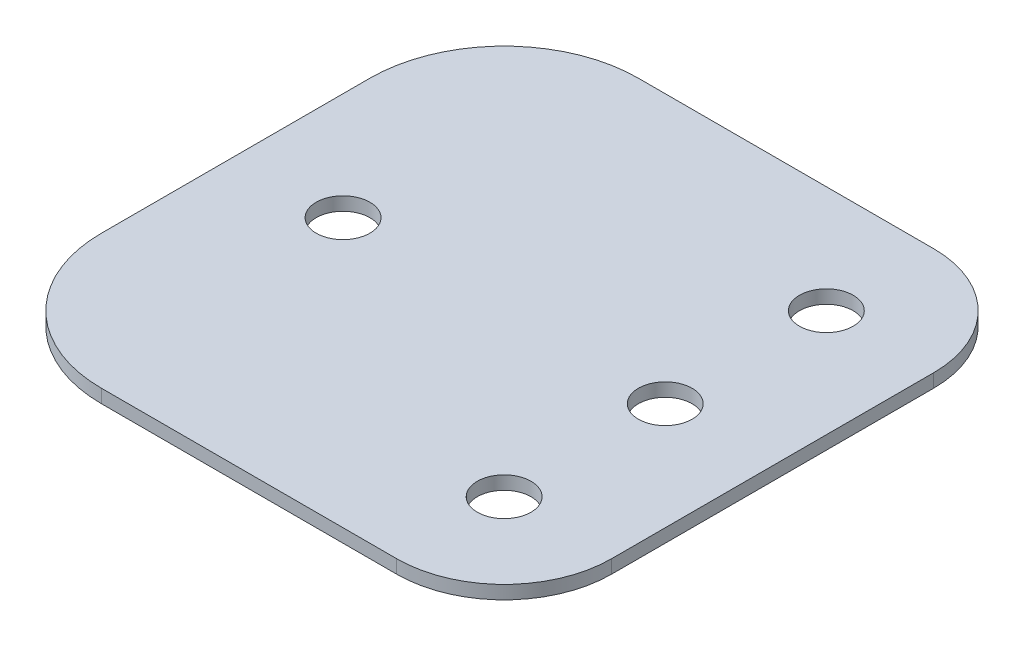
ISO-10303-21;
HEADER;
FILE_DESCRIPTION(('STEP AP214'),'2;1');
FILE_NAME('part.step','',(''),(''),'','','');
FILE_SCHEMA(('AUTOMOTIVE_DESIGN { 1 0 10303 214 1 1 1 1 }'));
ENDSEC;
DATA;
#1=APPLICATION_CONTEXT('core data for automotive mechanical design processes');
#2=APPLICATION_PROTOCOL_DEFINITION('international standard','automotive_design',2000,#1);
#3=PRODUCT_CONTEXT('',#1,'mechanical');
#4=PRODUCT('Part','Part','',(#3));
#5=PRODUCT_RELATED_PRODUCT_CATEGORY('part','',(#4));
#6=PRODUCT_DEFINITION_FORMATION('','',#4);
#7=PRODUCT_DEFINITION_CONTEXT('part definition',#1,'design');
#8=PRODUCT_DEFINITION('design','',#6,#7);
#9=PRODUCT_DEFINITION_SHAPE('','',#8);
#10=(LENGTH_UNIT() NAMED_UNIT(*) SI_UNIT(.MILLI.,.METRE.));
#11=(NAMED_UNIT(*) PLANE_ANGLE_UNIT() SI_UNIT($,.RADIAN.));
#12=(NAMED_UNIT(*) SI_UNIT($,.STERADIAN.) SOLID_ANGLE_UNIT());
#13=UNCERTAINTY_MEASURE_WITH_UNIT(LENGTH_MEASURE(1.E-05),#10,'distance_accuracy_value','');
#14=(GEOMETRIC_REPRESENTATION_CONTEXT(3) GLOBAL_UNCERTAINTY_ASSIGNED_CONTEXT((#13)) GLOBAL_UNIT_ASSIGNED_CONTEXT((#10,
#11,#12)) REPRESENTATION_CONTEXT('',''));
#15=CARTESIAN_POINT('',(0.,0.,0.));
#16=DIRECTION('',(0.,0.,1.));
#17=DIRECTION('',(1.,0.,0.));
#18=AXIS2_PLACEMENT_3D('',#15,#16,#17);
#19=CARTESIAN_POINT('',(0.,1.5875,0.));
#20=DIRECTION('',(0.,0.,1.));
#21=DIRECTION('',(1.,0.,0.));
#22=AXIS2_PLACEMENT_3D('',#19,#20,#21);
#23=PLANE('',#22);
#24=DIRECTION('',(-1.,0.,0.));
#25=VECTOR('',#24,1.);
#26=CARTESIAN_POINT('',(0.,0.,0.));
#27=LINE('',#26,#25);
#28=CARTESIAN_POINT('',(-12.7,0.,0.));
#29=VERTEX_POINT('',#28);
#30=CARTESIAN_POINT('',(-47.625,0.,0.));
#31=VERTEX_POINT('',#30);
#32=EDGE_CURVE('E156',#29,#31,#27,.T.);
#33=ORIENTED_EDGE('',*,*,#32,.F.);
#34=DIRECTION('',(0.,-1.,0.));
#35=VECTOR('',#34,1.);
#36=CARTESIAN_POINT('',(-12.7,1.5875,0.));
#37=LINE('',#36,#35);
#38=CARTESIAN_POINT('',(-12.7,1.5875,0.));
#39=VERTEX_POINT('',#38);
#40=EDGE_CURVE('E11',#39,#29,#37,.T.);
#41=ORIENTED_EDGE('',*,*,#40,.F.);
#42=DIRECTION('',(-1.,0.,0.));
#43=VECTOR('',#42,1.);
#44=CARTESIAN_POINT('',(0.,1.5875,0.));
#45=LINE('',#44,#43);
#46=CARTESIAN_POINT('',(-47.625,1.5875,0.));
#47=VERTEX_POINT('',#46);
#48=EDGE_CURVE('E365',#39,#47,#45,.T.);
#49=ORIENTED_EDGE('',*,*,#48,.T.);
#50=DIRECTION('',(0.,-1.,0.));
#51=VECTOR('',#50,1.);
#52=CARTESIAN_POINT('',(-47.625,1.5875,0.));
#53=LINE('',#52,#51);
#54=EDGE_CURVE('E93',#47,#31,#53,.T.);
#55=ORIENTED_EDGE('',*,*,#54,.T.);
#56=EDGE_LOOP('',(#33,#41,#49,#55));
#57=FACE_BOUND('',#56,.T.);
#58=ADVANCED_FACE('F41',(#57),#23,.T.);
#59=CARTESIAN_POINT('',(-12.7,1.5875,-12.7));
#60=DIRECTION('',(0.,-1.,0.));
#61=DIRECTION('',(0.,0.,-1.));
#62=AXIS2_PLACEMENT_3D('',#59,#60,#61);
#63=CYLINDRICAL_SURFACE('',#62,12.7);
#64=CARTESIAN_POINT('',(-12.7,0.,-12.7));
#65=DIRECTION('',(0.,1.,0.));
#66=DIRECTION('',(0.,0.,1.));
#67=AXIS2_PLACEMENT_3D('',#64,#65,#66);
#68=CIRCLE('',#67,12.7);
#69=CARTESIAN_POINT('',(0.,0.,-12.7));
#70=VERTEX_POINT('',#69);
#71=EDGE_CURVE('E160',#29,#70,#68,.T.);
#72=ORIENTED_EDGE('',*,*,#71,.T.);
#73=DIRECTION('',(0.,-1.,0.));
#74=VECTOR('',#73,1.);
#75=CARTESIAN_POINT('',(0.,1.5875,-12.7));
#76=LINE('',#75,#74);
#77=CARTESIAN_POINT('',(0.,1.5875,-12.7));
#78=VERTEX_POINT('',#77);
#79=EDGE_CURVE('E51',#78,#70,#76,.T.);
#80=ORIENTED_EDGE('',*,*,#79,.F.);
#81=CARTESIAN_POINT('',(-12.7,1.5875,-12.7));
#82=DIRECTION('',(0.,1.,0.));
#83=DIRECTION('',(0.,0.,1.));
#84=AXIS2_PLACEMENT_3D('',#81,#82,#83);
#85=CIRCLE('',#84,12.7);
#86=EDGE_CURVE('E360',#39,#78,#85,.T.);
#87=ORIENTED_EDGE('',*,*,#86,.F.);
#88=ORIENTED_EDGE('',*,*,#40,.T.);
#89=EDGE_LOOP('',(#72,#80,#87,#88));
#90=FACE_BOUND('',#89,.T.);
#91=ADVANCED_FACE('F209',(#90),#63,.T.);
#92=CARTESIAN_POINT('',(0.,1.5875,0.));
#93=DIRECTION('',(-1.,0.,0.));
#94=DIRECTION('',(0.,0.,1.));
#95=AXIS2_PLACEMENT_3D('',#92,#93,#94);
#96=PLANE('',#95);
#97=DIRECTION('',(0.,0.,-1.));
#98=VECTOR('',#97,1.);
#99=CARTESIAN_POINT('',(0.,0.,0.));
#100=LINE('',#99,#98);
#101=CARTESIAN_POINT('',(0.,0.,-50.8));
#102=VERTEX_POINT('',#101);
#103=EDGE_CURVE('E164',#70,#102,#100,.T.);
#104=ORIENTED_EDGE('',*,*,#103,.T.);
#105=DIRECTION('',(0.,-1.,0.));
#106=VECTOR('',#105,1.);
#107=CARTESIAN_POINT('',(0.,1.5875,-50.8));
#108=LINE('',#107,#106);
#109=CARTESIAN_POINT('',(0.,1.5875,-50.8));
#110=VERTEX_POINT('',#109);
#111=EDGE_CURVE('E195',#110,#102,#108,.T.);
#112=ORIENTED_EDGE('',*,*,#111,.F.);
#113=DIRECTION('',(0.,0.,-1.));
#114=VECTOR('',#113,1.);
#115=CARTESIAN_POINT('',(0.,1.5875,0.));
#116=LINE('',#115,#114);
#117=EDGE_CURVE('E205',#78,#110,#116,.T.);
#118=ORIENTED_EDGE('',*,*,#117,.F.);
#119=ORIENTED_EDGE('',*,*,#79,.T.);
#120=EDGE_LOOP('',(#104,#112,#118,#119));
#121=FACE_BOUND('',#120,.T.);
#122=ADVANCED_FACE('F202',(#121),#96,.F.);
#123=CARTESIAN_POINT('',(-12.7,1.5875,-50.8));
#124=DIRECTION('',(0.,-1.,0.));
#125=DIRECTION('',(0.,0.,-1.));
#126=AXIS2_PLACEMENT_3D('',#123,#124,#125);
#127=CYLINDRICAL_SURFACE('',#126,12.7);
#128=CARTESIAN_POINT('',(-12.7,0.,-50.8));
#129=DIRECTION('',(0.,1.,0.));
#130=DIRECTION('',(0.,0.,1.));
#131=AXIS2_PLACEMENT_3D('',#128,#129,#130);
#132=CIRCLE('',#131,12.7);
#133=CARTESIAN_POINT('',(-12.7,0.,-63.5));
#134=VERTEX_POINT('',#133);
#135=EDGE_CURVE('E168',#102,#134,#132,.T.);
#136=ORIENTED_EDGE('',*,*,#135,.T.);
#137=DIRECTION('',(0.,-1.,0.));
#138=VECTOR('',#137,1.);
#139=CARTESIAN_POINT('',(-12.7,1.5875,-63.5));
#140=LINE('',#139,#138);
#141=CARTESIAN_POINT('',(-12.7,1.5875,-63.5));
#142=VERTEX_POINT('',#141);
#143=EDGE_CURVE('E191',#142,#134,#140,.T.);
#144=ORIENTED_EDGE('',*,*,#143,.F.);
#145=CARTESIAN_POINT('',(-12.7,1.5875,-50.8));
#146=DIRECTION('',(0.,1.,0.));
#147=DIRECTION('',(0.,0.,1.));
#148=AXIS2_PLACEMENT_3D('',#145,#146,#147);
#149=CIRCLE('',#148,12.7);
#150=EDGE_CURVE('E356',#110,#142,#149,.T.);
#151=ORIENTED_EDGE('',*,*,#150,.F.);
#152=ORIENTED_EDGE('',*,*,#111,.T.);
#153=EDGE_LOOP('',(#136,#144,#151,#152));
#154=FACE_BOUND('',#153,.T.);
#155=ADVANCED_FACE('F265',(#154),#127,.T.);
#156=CARTESIAN_POINT('',(0.,1.5875,-63.5));
#157=DIRECTION('',(0.,0.,1.));
#158=DIRECTION('',(1.,0.,0.));
#159=AXIS2_PLACEMENT_3D('',#156,#157,#158);
#160=PLANE('',#159);
#161=DIRECTION('',(-1.,0.,0.));
#162=VECTOR('',#161,1.);
#163=CARTESIAN_POINT('',(0.,0.,-63.5));
#164=LINE('',#163,#162);
#165=CARTESIAN_POINT('',(-47.625,0.,-63.5));
#166=VERTEX_POINT('',#165);
#167=EDGE_CURVE('E172',#134,#166,#164,.T.);
#168=ORIENTED_EDGE('',*,*,#167,.T.);
#169=DIRECTION('',(0.,-1.,0.));
#170=VECTOR('',#169,1.);
#171=CARTESIAN_POINT('',(-47.625,1.5875,-63.5));
#172=LINE('',#171,#170);
#173=CARTESIAN_POINT('',(-47.625,1.5875,-63.5));
#174=VERTEX_POINT('',#173);
#175=EDGE_CURVE('E124',#174,#166,#172,.T.);
#176=ORIENTED_EDGE('',*,*,#175,.F.);
#177=DIRECTION('',(-1.,0.,0.));
#178=VECTOR('',#177,1.);
#179=CARTESIAN_POINT('',(0.,1.5875,-63.5));
#180=LINE('',#179,#178);
#181=EDGE_CURVE('E129',#142,#174,#180,.T.);
#182=ORIENTED_EDGE('',*,*,#181,.F.);
#183=ORIENTED_EDGE('',*,*,#143,.T.);
#184=EDGE_LOOP('',(#168,#176,#182,#183));
#185=FACE_BOUND('',#184,.T.);
#186=ADVANCED_FACE('F262',(#185),#160,.F.);
#187=CARTESIAN_POINT('',(-47.625,1.5875,-47.625));
#188=DIRECTION('',(0.,-1.,0.));
#189=DIRECTION('',(0.,0.,-1.));
#190=AXIS2_PLACEMENT_3D('',#187,#188,#189);
#191=CYLINDRICAL_SURFACE('',#190,15.875);
#192=CARTESIAN_POINT('',(-47.625,0.,-47.625));
#193=DIRECTION('',(0.,1.,0.));
#194=DIRECTION('',(0.,0.,1.));
#195=AXIS2_PLACEMENT_3D('',#192,#193,#194);
#196=CIRCLE('',#195,15.875);
#197=CARTESIAN_POINT('',(-63.5,0.,-47.625));
#198=VERTEX_POINT('',#197);
#199=EDGE_CURVE('E118',#198,#166,#196,.F.);
#200=ORIENTED_EDGE('',*,*,#199,.F.);
#201=DIRECTION('',(0.,-1.,0.));
#202=VECTOR('',#201,1.);
#203=CARTESIAN_POINT('',(-63.5,1.5875,-47.625));
#204=LINE('',#203,#202);
#205=CARTESIAN_POINT('',(-63.5,1.5875,-47.625));
#206=VERTEX_POINT('',#205);
#207=EDGE_CURVE('E113',#206,#198,#204,.T.);
#208=ORIENTED_EDGE('',*,*,#207,.F.);
#209=CARTESIAN_POINT('',(-47.625,1.5875,-47.625));
#210=DIRECTION('',(0.,1.,0.));
#211=DIRECTION('',(0.,0.,1.));
#212=AXIS2_PLACEMENT_3D('',#209,#210,#211);
#213=CIRCLE('',#212,15.875);
#214=EDGE_CURVE('E116',#206,#174,#213,.F.);
#215=ORIENTED_EDGE('',*,*,#214,.T.);
#216=ORIENTED_EDGE('',*,*,#175,.T.);
#217=EDGE_LOOP('',(#200,#208,#215,#216));
#218=FACE_BOUND('',#217,.T.);
#219=ADVANCED_FACE('F115',(#218),#191,.T.);
#220=CARTESIAN_POINT('',(-63.5000000000002,1.5875,-2.77555756156293E-13));
#221=DIRECTION('',(-1.,0.,0.));
#222=DIRECTION('',(0.,0.,1.));
#223=AXIS2_PLACEMENT_3D('',#220,#221,#222);
#224=PLANE('',#223);
#225=DIRECTION('',(0.,0.,-1.));
#226=VECTOR('',#225,1.);
#227=CARTESIAN_POINT('',(-63.5000000000002,0.,-2.77555756156293E-13));
#228=LINE('',#227,#226);
#229=CARTESIAN_POINT('',(-63.5,0.,-15.875));
#230=VERTEX_POINT('',#229);
#231=EDGE_CURVE('E178',#230,#198,#228,.T.);
#232=ORIENTED_EDGE('',*,*,#231,.F.);
#233=DIRECTION('',(0.,-1.,0.));
#234=VECTOR('',#233,1.);
#235=CARTESIAN_POINT('',(-63.5,1.5875,-15.875));
#236=LINE('',#235,#234);
#237=CARTESIAN_POINT('',(-63.5,1.5875,-15.875));
#238=VERTEX_POINT('',#237);
#239=EDGE_CURVE('E86',#238,#230,#236,.T.);
#240=ORIENTED_EDGE('',*,*,#239,.F.);
#241=DIRECTION('',(0.,0.,-1.));
#242=VECTOR('',#241,1.);
#243=CARTESIAN_POINT('',(-63.5000000000002,1.5875,-2.77555756156293E-13));
#244=LINE('',#243,#242);
#245=EDGE_CURVE('E127',#238,#206,#244,.T.);
#246=ORIENTED_EDGE('',*,*,#245,.T.);
#247=ORIENTED_EDGE('',*,*,#207,.T.);
#248=EDGE_LOOP('',(#232,#240,#246,#247));
#249=FACE_BOUND('',#248,.T.);
#250=ADVANCED_FACE('F133',(#249),#224,.T.);
#251=CARTESIAN_POINT('',(-50.8,1.5875,-31.75));
#252=DIRECTION('',(0.,-1.,0.));
#253=DIRECTION('',(0.,0.,-1.));
#254=AXIS2_PLACEMENT_3D('',#251,#252,#253);
#255=CYLINDRICAL_SURFACE('',#254,3.17499999999999);
#256=CARTESIAN_POINT('',(-50.8,1.5875,-31.75));
#257=DIRECTION('',(0.,1.,0.));
#258=DIRECTION('',(0.,0.,1.));
#259=AXIS2_PLACEMENT_3D('',#256,#257,#258);
#260=CIRCLE('',#259,3.17499999999999);
#261=CARTESIAN_POINT('',(-50.8,1.5875,-28.575));
#262=VERTEX_POINT('',#261);
#263=EDGE_CURVE('E368',#262,#262,#260,.T.);
#264=ORIENTED_EDGE('',*,*,#263,.T.);
#265=EDGE_LOOP('',(#264));
#266=FACE_BOUND('',#265,.T.);
#267=CARTESIAN_POINT('',(-50.8,0.,-31.75));
#268=DIRECTION('',(0.,1.,0.));
#269=DIRECTION('',(0.,0.,1.));
#270=AXIS2_PLACEMENT_3D('',#267,#268,#269);
#271=CIRCLE('',#270,3.17499999999999);
#272=CARTESIAN_POINT('',(-50.8,0.,-28.575));
#273=VERTEX_POINT('',#272);
#274=EDGE_CURVE('E152',#273,#273,#271,.T.);
#275=ORIENTED_EDGE('',*,*,#274,.F.);
#276=EDGE_LOOP('',(#275));
#277=FACE_BOUND('',#276,.T.);
#278=ADVANCED_FACE('F220',(#266,#277),#255,.F.);
#279=CARTESIAN_POINT('',(-12.7,1.5875,-12.7));
#280=DIRECTION('',(0.,-1.,0.));
#281=DIRECTION('',(0.,0.,-1.));
#282=AXIS2_PLACEMENT_3D('',#279,#280,#281);
#283=CYLINDRICAL_SURFACE('',#282,3.175);
#284=CARTESIAN_POINT('',(-12.7,1.5875,-12.7));
#285=DIRECTION('',(0.,1.,0.));
#286=DIRECTION('',(0.,0.,1.));
#287=AXIS2_PLACEMENT_3D('',#284,#285,#286);
#288=CIRCLE('',#287,3.175);
#289=CARTESIAN_POINT('',(-12.7,1.5875,-9.525));
#290=VERTEX_POINT('',#289);
#291=EDGE_CURVE('E372',#290,#290,#288,.T.);
#292=ORIENTED_EDGE('',*,*,#291,.T.);
#293=EDGE_LOOP('',(#292));
#294=FACE_BOUND('',#293,.T.);
#295=CARTESIAN_POINT('',(-12.7,0.,-12.7));
#296=DIRECTION('',(0.,1.,0.));
#297=DIRECTION('',(0.,0.,1.));
#298=AXIS2_PLACEMENT_3D('',#295,#296,#297);
#299=CIRCLE('',#298,3.175);
#300=CARTESIAN_POINT('',(-12.7,0.,-9.525));
#301=VERTEX_POINT('',#300);
#302=EDGE_CURVE('E148',#301,#301,#299,.T.);
#303=ORIENTED_EDGE('',*,*,#302,.F.);
#304=EDGE_LOOP('',(#303));
#305=FACE_BOUND('',#304,.T.);
#306=ADVANCED_FACE('F223',(#294,#305),#283,.F.);
#307=CARTESIAN_POINT('',(-12.7,1.5875,-31.75));
#308=DIRECTION('',(0.,-1.,0.));
#309=DIRECTION('',(0.,0.,-1.));
#310=AXIS2_PLACEMENT_3D('',#307,#308,#309);
#311=CYLINDRICAL_SURFACE('',#310,3.175);
#312=CARTESIAN_POINT('',(-12.7,1.5875,-31.75));
#313=DIRECTION('',(0.,1.,0.));
#314=DIRECTION('',(0.,0.,1.));
#315=AXIS2_PLACEMENT_3D('',#312,#313,#314);
#316=CIRCLE('',#315,3.175);
#317=CARTESIAN_POINT('',(-12.7,1.5875,-28.575));
#318=VERTEX_POINT('',#317);
#319=EDGE_CURVE('E238',#318,#318,#316,.T.);
#320=ORIENTED_EDGE('',*,*,#319,.T.);
#321=EDGE_LOOP('',(#320));
#322=FACE_BOUND('',#321,.T.);
#323=CARTESIAN_POINT('',(-12.7,0.,-31.75));
#324=DIRECTION('',(0.,1.,0.));
#325=DIRECTION('',(0.,0.,1.));
#326=AXIS2_PLACEMENT_3D('',#323,#324,#325);
#327=CIRCLE('',#326,3.175);
#328=CARTESIAN_POINT('',(-12.7,0.,-28.575));
#329=VERTEX_POINT('',#328);
#330=EDGE_CURVE('E144',#329,#329,#327,.T.);
#331=ORIENTED_EDGE('',*,*,#330,.F.);
#332=EDGE_LOOP('',(#331));
#333=FACE_BOUND('',#332,.T.);
#334=ADVANCED_FACE('F226',(#322,#333),#311,.F.);
#335=CARTESIAN_POINT('',(-12.7,1.5875,-50.8));
#336=DIRECTION('',(0.,-1.,0.));
#337=DIRECTION('',(0.,0.,-1.));
#338=AXIS2_PLACEMENT_3D('',#335,#336,#337);
#339=CYLINDRICAL_SURFACE('',#338,3.175);
#340=CARTESIAN_POINT('',(-12.7,1.5875,-50.8));
#341=DIRECTION('',(0.,1.,0.));
#342=DIRECTION('',(0.,0.,1.));
#343=AXIS2_PLACEMENT_3D('',#340,#341,#342);
#344=CIRCLE('',#343,3.175);
#345=CARTESIAN_POINT('',(-12.7,1.5875,-47.625));
#346=VERTEX_POINT('',#345);
#347=EDGE_CURVE('E184',#346,#346,#344,.T.);
#348=ORIENTED_EDGE('',*,*,#347,.T.);
#349=EDGE_LOOP('',(#348));
#350=FACE_BOUND('',#349,.T.);
#351=CARTESIAN_POINT('',(-12.7,0.,-50.8));
#352=DIRECTION('',(0.,1.,0.));
#353=DIRECTION('',(0.,0.,1.));
#354=AXIS2_PLACEMENT_3D('',#351,#352,#353);
#355=CIRCLE('',#354,3.175);
#356=CARTESIAN_POINT('',(-12.7,0.,-47.625));
#357=VERTEX_POINT('',#356);
#358=EDGE_CURVE('E140',#357,#357,#355,.T.);
#359=ORIENTED_EDGE('',*,*,#358,.F.);
#360=EDGE_LOOP('',(#359));
#361=FACE_BOUND('',#360,.T.);
#362=ADVANCED_FACE('F43',(#350,#361),#339,.F.);
#363=CARTESIAN_POINT('',(-47.625,1.5875,-15.875));
#364=DIRECTION('',(0.,-1.,0.));
#365=DIRECTION('',(0.,0.,-1.));
#366=AXIS2_PLACEMENT_3D('',#363,#364,#365);
#367=CYLINDRICAL_SURFACE('',#366,15.875);
#368=CARTESIAN_POINT('',(-47.625,0.,-15.875));
#369=DIRECTION('',(0.,1.,0.));
#370=DIRECTION('',(0.,0.,1.));
#371=AXIS2_PLACEMENT_3D('',#368,#369,#370);
#372=CIRCLE('',#371,15.875);
#373=EDGE_CURVE('E181',#230,#31,#372,.T.);
#374=ORIENTED_EDGE('',*,*,#373,.T.);
#375=ORIENTED_EDGE('',*,*,#54,.F.);
#376=CARTESIAN_POINT('',(-47.625,1.5875,-15.875));
#377=DIRECTION('',(0.,1.,0.));
#378=DIRECTION('',(0.,0.,1.));
#379=AXIS2_PLACEMENT_3D('',#376,#377,#378);
#380=CIRCLE('',#379,15.875);
#381=EDGE_CURVE('E59',#238,#47,#380,.T.);
#382=ORIENTED_EDGE('',*,*,#381,.F.);
#383=ORIENTED_EDGE('',*,*,#239,.T.);
#384=EDGE_LOOP('',(#374,#375,#382,#383));
#385=FACE_BOUND('',#384,.T.);
#386=ADVANCED_FACE('F233',(#385),#367,.T.);
#387=CARTESIAN_POINT('',(0.,1.5875,0.));
#388=DIRECTION('',(0.,1.,0.));
#389=DIRECTION('',(0.,0.,1.));
#390=AXIS2_PLACEMENT_3D('',#387,#388,#389);
#391=PLANE('',#390);
#392=ORIENTED_EDGE('',*,*,#347,.F.);
#393=EDGE_LOOP('',(#392));
#394=FACE_BOUND('',#393,.T.);
#395=ORIENTED_EDGE('',*,*,#319,.F.);
#396=EDGE_LOOP('',(#395));
#397=FACE_BOUND('',#396,.T.);
#398=ORIENTED_EDGE('',*,*,#291,.F.);
#399=EDGE_LOOP('',(#398));
#400=FACE_BOUND('',#399,.T.);
#401=ORIENTED_EDGE('',*,*,#263,.F.);
#402=EDGE_LOOP('',(#401));
#403=FACE_BOUND('',#402,.T.);
#404=ORIENTED_EDGE('',*,*,#48,.F.);
#405=ORIENTED_EDGE('',*,*,#86,.T.);
#406=ORIENTED_EDGE('',*,*,#117,.T.);
#407=ORIENTED_EDGE('',*,*,#150,.T.);
#408=ORIENTED_EDGE('',*,*,#181,.T.);
#409=ORIENTED_EDGE('',*,*,#214,.F.);
#410=ORIENTED_EDGE('',*,*,#245,.F.);
#411=ORIENTED_EDGE('',*,*,#381,.T.);
#412=EDGE_LOOP('',(#404,#405,#406,#407,#408,#409,#410,#411));
#413=FACE_BOUND('',#412,.T.);
#414=ADVANCED_FACE('F126',(#394,#397,#400,#403,#413),#391,.T.);
#415=CARTESIAN_POINT('',(0.,0.,0.));
#416=DIRECTION('',(0.,1.,0.));
#417=DIRECTION('',(0.,0.,1.));
#418=AXIS2_PLACEMENT_3D('',#415,#416,#417);
#419=PLANE('',#418);
#420=ORIENTED_EDGE('',*,*,#358,.T.);
#421=EDGE_LOOP('',(#420));
#422=FACE_BOUND('',#421,.T.);
#423=ORIENTED_EDGE('',*,*,#330,.T.);
#424=EDGE_LOOP('',(#423));
#425=FACE_BOUND('',#424,.T.);
#426=ORIENTED_EDGE('',*,*,#302,.T.);
#427=EDGE_LOOP('',(#426));
#428=FACE_BOUND('',#427,.T.);
#429=ORIENTED_EDGE('',*,*,#274,.T.);
#430=EDGE_LOOP('',(#429));
#431=FACE_BOUND('',#430,.T.);
#432=ORIENTED_EDGE('',*,*,#32,.T.);
#433=ORIENTED_EDGE('',*,*,#373,.F.);
#434=ORIENTED_EDGE('',*,*,#231,.T.);
#435=ORIENTED_EDGE('',*,*,#199,.T.);
#436=ORIENTED_EDGE('',*,*,#167,.F.);
#437=ORIENTED_EDGE('',*,*,#135,.F.);
#438=ORIENTED_EDGE('',*,*,#103,.F.);
#439=ORIENTED_EDGE('',*,*,#71,.F.);
#440=EDGE_LOOP('',(#432,#433,#434,#435,#436,#437,#438,#439));
#441=FACE_BOUND('',#440,.T.);
#442=ADVANCED_FACE('F211',(#422,#425,#428,#431,#441),#419,.F.);
#443=CLOSED_SHELL('',(#58,#91,#122,#155,#186,#219,#250,#278,#306,#334,#362,#386,#414,#442));
#444=MANIFOLD_SOLID_BREP('B2',#443);
#445=ADVANCED_BREP_SHAPE_REPRESENTATION('',(#18,#444),#14);
#446=SHAPE_DEFINITION_REPRESENTATION(#9,#445);
ENDSEC;
END-ISO-10303-21;
